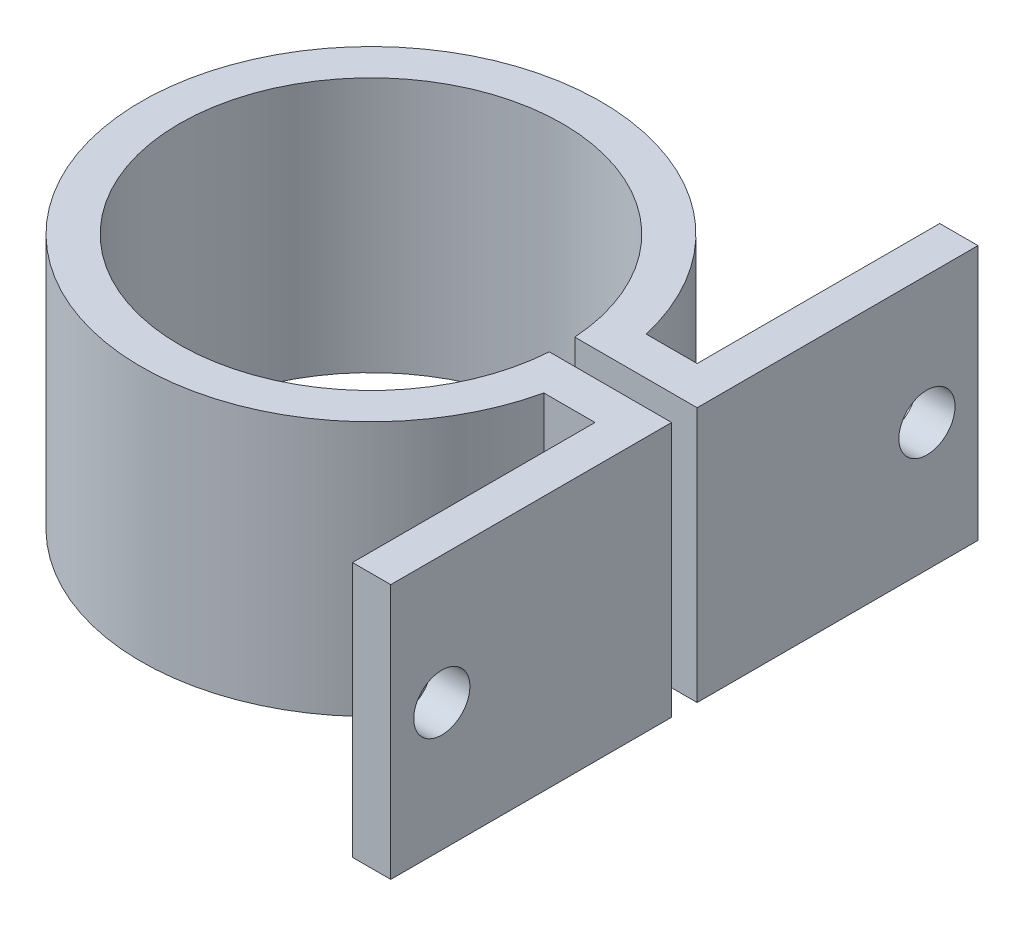
ISO-10303-21;
HEADER;
FILE_DESCRIPTION(('STEP AP214'),'2;1');
FILE_NAME('part.step','',(''),(''),'','','');
FILE_SCHEMA(('AUTOMOTIVE_DESIGN { 1 0 10303 214 1 1 1 1 }'));
ENDSEC;
DATA;
#1=APPLICATION_CONTEXT('core data for automotive mechanical design processes');
#2=APPLICATION_PROTOCOL_DEFINITION('international standard','automotive_design',2000,#1);
#3=PRODUCT_CONTEXT('',#1,'mechanical');
#4=PRODUCT('Part','Part','',(#3));
#5=PRODUCT_RELATED_PRODUCT_CATEGORY('part','',(#4));
#6=PRODUCT_DEFINITION_FORMATION('','',#4);
#7=PRODUCT_DEFINITION_CONTEXT('part definition',#1,'design');
#8=PRODUCT_DEFINITION('design','',#6,#7);
#9=PRODUCT_DEFINITION_SHAPE('','',#8);
#10=(LENGTH_UNIT() NAMED_UNIT(*) SI_UNIT(.MILLI.,.METRE.));
#11=(NAMED_UNIT(*) PLANE_ANGLE_UNIT() SI_UNIT($,.RADIAN.));
#12=(NAMED_UNIT(*) SI_UNIT($,.STERADIAN.) SOLID_ANGLE_UNIT());
#13=UNCERTAINTY_MEASURE_WITH_UNIT(LENGTH_MEASURE(1.E-05),#10,'distance_accuracy_value','');
#14=(GEOMETRIC_REPRESENTATION_CONTEXT(3) GLOBAL_UNCERTAINTY_ASSIGNED_CONTEXT((#13)) GLOBAL_UNIT_ASSIGNED_CONTEXT((#10,
#11,#12)) REPRESENTATION_CONTEXT('',''));
#15=CARTESIAN_POINT('',(0.,0.,0.));
#16=DIRECTION('',(0.,0.,1.));
#17=DIRECTION('',(1.,0.,0.));
#18=AXIS2_PLACEMENT_3D('',#15,#16,#17);
#19=CARTESIAN_POINT('',(0.,20.,-4.00000000000013));
#20=DIRECTION('',(0.,0.,-1.));
#21=DIRECTION('',(-1.,0.,0.));
#22=AXIS2_PLACEMENT_3D('',#19,#20,#21);
#23=PLANE('',#22);
#24=DIRECTION('',(1.,0.,0.));
#25=VECTOR('',#24,1.);
#26=CARTESIAN_POINT('',(0.,0.,-4.00000000000013));
#27=LINE('',#26,#25);
#28=CARTESIAN_POINT('',(17.5499287747842,0.,-4.00000000000006));
#29=VERTEX_POINT('',#28);
#30=CARTESIAN_POINT('',(21.5499287747842,0.,-4.00000000000005));
#31=VERTEX_POINT('',#30);
#32=EDGE_CURVE('E164',#29,#31,#27,.T.);
#33=ORIENTED_EDGE('',*,*,#32,.F.);
#34=DIRECTION('',(0.,-1.,0.));
#35=VECTOR('',#34,1.);
#36=CARTESIAN_POINT('',(17.5499287747842,20.,-4.00000000000006));
#37=LINE('',#36,#35);
#38=CARTESIAN_POINT('',(17.5499287747842,20.,-4.00000000000006));
#39=VERTEX_POINT('',#38);
#40=EDGE_CURVE('E11',#39,#29,#37,.T.);
#41=ORIENTED_EDGE('',*,*,#40,.F.);
#42=DIRECTION('',(1.,0.,0.));
#43=VECTOR('',#42,1.);
#44=CARTESIAN_POINT('',(0.,20.,-4.00000000000013));
#45=LINE('',#44,#43);
#46=CARTESIAN_POINT('',(21.5499287747842,20.,-4.00000000000005));
#47=VERTEX_POINT('',#46);
#48=EDGE_CURVE('E206',#39,#47,#45,.T.);
#49=ORIENTED_EDGE('',*,*,#48,.T.);
#50=DIRECTION('',(0.,-1.,0.));
#51=VECTOR('',#50,1.);
#52=CARTESIAN_POINT('',(21.5499287747842,20.,-4.00000000000005));
#53=LINE('',#52,#51);
#54=EDGE_CURVE('E104',#47,#31,#53,.T.);
#55=ORIENTED_EDGE('',*,*,#54,.T.);
#56=EDGE_LOOP('',(#33,#41,#49,#55));
#57=FACE_BOUND('',#56,.T.);
#58=ADVANCED_FACE('F41',(#57),#23,.T.);
#59=CARTESIAN_POINT('',(0.,20.,0.));
#60=DIRECTION('',(0.,-1.,0.));
#61=DIRECTION('',(0.,0.,-1.));
#62=AXIS2_PLACEMENT_3D('',#59,#60,#61);
#63=CYLINDRICAL_SURFACE('',#62,18.);
#64=CARTESIAN_POINT('',(0.,0.,0.));
#65=DIRECTION('',(0.,1.,0.));
#66=DIRECTION('',(0.,0.,1.));
#67=AXIS2_PLACEMENT_3D('',#64,#65,#66);
#68=CIRCLE('',#67,18.);
#69=CARTESIAN_POINT('',(17.5499287747842,0.,4.00000000000014));
#70=VERTEX_POINT('',#69);
#71=EDGE_CURVE('E168',#29,#70,#68,.T.);
#72=ORIENTED_EDGE('',*,*,#71,.T.);
#73=DIRECTION('',(0.,-1.,0.));
#74=VECTOR('',#73,1.);
#75=CARTESIAN_POINT('',(17.5499287747842,20.,4.00000000000014));
#76=LINE('',#75,#74);
#77=CARTESIAN_POINT('',(17.5499287747842,20.,4.00000000000014));
#78=VERTEX_POINT('',#77);
#79=EDGE_CURVE('E50',#78,#70,#76,.T.);
#80=ORIENTED_EDGE('',*,*,#79,.F.);
#81=CARTESIAN_POINT('',(0.,20.,0.));
#82=DIRECTION('',(0.,1.,0.));
#83=DIRECTION('',(0.,0.,1.));
#84=AXIS2_PLACEMENT_3D('',#81,#82,#83);
#85=CIRCLE('',#84,18.);
#86=EDGE_CURVE('E303',#39,#78,#85,.T.);
#87=ORIENTED_EDGE('',*,*,#86,.F.);
#88=ORIENTED_EDGE('',*,*,#40,.T.);
#89=EDGE_LOOP('',(#72,#80,#87,#88));
#90=FACE_BOUND('',#89,.T.);
#91=ADVANCED_FACE('F297',(#90),#63,.T.);
#92=CARTESIAN_POINT('',(1.95156391047439E-13,20.,4.00000000000099));
#93=DIRECTION('',(0.,0.,-1.));
#94=DIRECTION('',(-1.,0.,0.));
#95=AXIS2_PLACEMENT_3D('',#92,#93,#94);
#96=PLANE('',#95);
#97=DIRECTION('',(1.,0.,0.));
#98=VECTOR('',#97,1.);
#99=CARTESIAN_POINT('',(1.95156391047439E-13,0.,4.00000000000099));
#100=LINE('',#99,#98);
#101=CARTESIAN_POINT('',(21.5499287747842,0.,3.99999999999994));
#102=VERTEX_POINT('',#101);
#103=EDGE_CURVE('E172',#70,#102,#100,.T.);
#104=ORIENTED_EDGE('',*,*,#103,.T.);
#105=DIRECTION('',(0.,-1.,0.));
#106=VECTOR('',#105,1.);
#107=CARTESIAN_POINT('',(21.5499287747842,20.,3.99999999999994));
#108=LINE('',#107,#106);
#109=CARTESIAN_POINT('',(21.5499287747842,20.,3.99999999999994));
#110=VERTEX_POINT('',#109);
#111=EDGE_CURVE('E229',#110,#102,#108,.T.);
#112=ORIENTED_EDGE('',*,*,#111,.F.);
#113=DIRECTION('',(1.,0.,0.));
#114=VECTOR('',#113,1.);
#115=CARTESIAN_POINT('',(1.95156391047439E-13,20.,4.00000000000099));
#116=LINE('',#115,#114);
#117=EDGE_CURVE('E240',#78,#110,#116,.T.);
#118=ORIENTED_EDGE('',*,*,#117,.F.);
#119=ORIENTED_EDGE('',*,*,#79,.T.);
#120=EDGE_LOOP('',(#104,#112,#118,#119));
#121=FACE_BOUND('',#120,.T.);
#122=ADVANCED_FACE('F238',(#121),#96,.F.);
#123=CARTESIAN_POINT('',(21.5499287747842,20.,0.));
#124=DIRECTION('',(1.,0.,0.));
#125=DIRECTION('',(0.,0.,-1.));
#126=AXIS2_PLACEMENT_3D('',#123,#124,#125);
#127=PLANE('',#126);
#128=CARTESIAN_POINT('',(21.5499287747842,10.,18.9999999999999));
#129=DIRECTION('',(1.,0.,0.));
#130=DIRECTION('',(0.,0.,-1.));
#131=AXIS2_PLACEMENT_3D('',#128,#129,#130);
#132=CIRCLE('',#131,2.2);
#133=CARTESIAN_POINT('',(21.5499287747842,10.,16.7999999999999));
#134=VERTEX_POINT('',#133);
#135=EDGE_CURVE('E308',#134,#134,#132,.F.);
#136=ORIENTED_EDGE('',*,*,#135,.F.);
#137=EDGE_LOOP('',(#136));
#138=FACE_BOUND('',#137,.T.);
#139=DIRECTION('',(0.,0.,1.));
#140=VECTOR('',#139,1.);
#141=CARTESIAN_POINT('',(21.5499287747842,0.,0.));
#142=LINE('',#141,#140);
#143=CARTESIAN_POINT('',(21.5499287747842,0.,22.9999999999999));
#144=VERTEX_POINT('',#143);
#145=EDGE_CURVE('E175',#102,#144,#142,.T.);
#146=ORIENTED_EDGE('',*,*,#145,.T.);
#147=DIRECTION('',(0.,-1.,0.));
#148=VECTOR('',#147,1.);
#149=CARTESIAN_POINT('',(21.5499287747842,20.,22.9999999999999));
#150=LINE('',#149,#148);
#151=CARTESIAN_POINT('',(21.5499287747842,20.,22.9999999999999));
#152=VERTEX_POINT('',#151);
#153=EDGE_CURVE('E225',#152,#144,#150,.T.);
#154=ORIENTED_EDGE('',*,*,#153,.F.);
#155=DIRECTION('',(0.,0.,1.));
#156=VECTOR('',#155,1.);
#157=CARTESIAN_POINT('',(21.5499287747842,20.,0.));
#158=LINE('',#157,#156);
#159=EDGE_CURVE('E260',#110,#152,#158,.T.);
#160=ORIENTED_EDGE('',*,*,#159,.F.);
#161=ORIENTED_EDGE('',*,*,#111,.T.);
#162=EDGE_LOOP('',(#146,#154,#160,#161));
#163=FACE_BOUND('',#162,.T.);
#164=ADVANCED_FACE('F249',(#138,#163),#127,.F.);
#165=CARTESIAN_POINT('',(0.,20.,22.9999999999999));
#166=DIRECTION('',(0.,0.,-1.));
#167=DIRECTION('',(-1.,0.,0.));
#168=AXIS2_PLACEMENT_3D('',#165,#166,#167);
#169=PLANE('',#168);
#170=DIRECTION('',(1.,0.,0.));
#171=VECTOR('',#170,1.);
#172=CARTESIAN_POINT('',(0.,0.,22.9999999999999));
#173=LINE('',#172,#171);
#174=CARTESIAN_POINT('',(24.5499287747842,0.,22.9999999999999));
#175=VERTEX_POINT('',#174);
#176=EDGE_CURVE('E178',#144,#175,#173,.T.);
#177=ORIENTED_EDGE('',*,*,#176,.T.);
#178=DIRECTION('',(0.,-1.,0.));
#179=VECTOR('',#178,1.);
#180=CARTESIAN_POINT('',(24.5499287747842,20.,22.9999999999999));
#181=LINE('',#180,#179);
#182=CARTESIAN_POINT('',(24.5499287747842,20.,22.9999999999999));
#183=VERTEX_POINT('',#182);
#184=EDGE_CURVE('E222',#183,#175,#181,.T.);
#185=ORIENTED_EDGE('',*,*,#184,.F.);
#186=DIRECTION('',(1.,0.,0.));
#187=VECTOR('',#186,1.);
#188=CARTESIAN_POINT('',(0.,20.,22.9999999999999));
#189=LINE('',#188,#187);
#190=EDGE_CURVE('E255',#152,#183,#189,.T.);
#191=ORIENTED_EDGE('',*,*,#190,.F.);
#192=ORIENTED_EDGE('',*,*,#153,.T.);
#193=EDGE_LOOP('',(#177,#185,#191,#192));
#194=FACE_BOUND('',#193,.T.);
#195=ADVANCED_FACE('F253',(#194),#169,.F.);
#196=CARTESIAN_POINT('',(24.5499287747842,20.,0.));
#197=DIRECTION('',(1.,0.,0.));
#198=DIRECTION('',(0.,0.,-1.));
#199=AXIS2_PLACEMENT_3D('',#196,#197,#198);
#200=PLANE('',#199);
#201=CARTESIAN_POINT('',(24.5499287747843,10.,18.9999999999999));
#202=DIRECTION('',(1.,0.,0.));
#203=DIRECTION('',(0.,0.,-1.));
#204=AXIS2_PLACEMENT_3D('',#201,#202,#203);
#205=CIRCLE('',#204,2.2);
#206=CARTESIAN_POINT('',(24.5499287747843,10.,16.7999999999999));
#207=VERTEX_POINT('',#206);
#208=EDGE_CURVE('E314',#207,#207,#205,.T.);
#209=ORIENTED_EDGE('',*,*,#208,.F.);
#210=EDGE_LOOP('',(#209));
#211=FACE_BOUND('',#210,.T.);
#212=DIRECTION('',(0.,0.,1.));
#213=VECTOR('',#212,1.);
#214=CARTESIAN_POINT('',(24.5499287747842,0.,0.));
#215=LINE('',#214,#213);
#216=CARTESIAN_POINT('',(24.5499287747842,0.,0.999999999999942));
#217=VERTEX_POINT('',#216);
#218=EDGE_CURVE('E182',#217,#175,#215,.T.);
#219=ORIENTED_EDGE('',*,*,#218,.F.);
#220=DIRECTION('',(0.,-1.,0.));
#221=VECTOR('',#220,1.);
#222=CARTESIAN_POINT('',(24.5499287747842,20.,0.999999999999942));
#223=LINE('',#222,#221);
#224=CARTESIAN_POINT('',(24.5499287747842,20.,0.999999999999942));
#225=VERTEX_POINT('',#224);
#226=EDGE_CURVE('E219',#225,#217,#223,.T.);
#227=ORIENTED_EDGE('',*,*,#226,.F.);
#228=DIRECTION('',(0.,0.,1.));
#229=VECTOR('',#228,1.);
#230=CARTESIAN_POINT('',(24.5499287747842,20.,0.));
#231=LINE('',#230,#229);
#232=EDGE_CURVE('E259',#225,#183,#231,.T.);
#233=ORIENTED_EDGE('',*,*,#232,.T.);
#234=ORIENTED_EDGE('',*,*,#184,.T.);
#235=EDGE_LOOP('',(#219,#227,#233,#234));
#236=FACE_BOUND('',#235,.T.);
#237=ADVANCED_FACE('F379',(#211,#236),#200,.T.);
#238=CARTESIAN_POINT('',(0.,20.,1.00000000000044));
#239=DIRECTION('',(0.,0.,-1.));
#240=DIRECTION('',(-1.,0.,0.));
#241=AXIS2_PLACEMENT_3D('',#238,#239,#240);
#242=PLANE('',#241);
#243=DIRECTION('',(1.,0.,0.));
#244=VECTOR('',#243,1.);
#245=CARTESIAN_POINT('',(0.,0.,1.00000000000044));
#246=LINE('',#245,#244);
#247=CARTESIAN_POINT('',(14.9666295470958,0.,1.00000000000014));
#248=VERTEX_POINT('',#247);
#249=EDGE_CURVE('E186',#248,#217,#246,.T.);
#250=ORIENTED_EDGE('',*,*,#249,.F.);
#251=DIRECTION('',(0.,-1.,0.));
#252=VECTOR('',#251,1.);
#253=CARTESIAN_POINT('',(14.9666295470958,20.,1.00000000000014));
#254=LINE('',#253,#252);
#255=CARTESIAN_POINT('',(14.9666295470958,20.,1.00000000000014));
#256=VERTEX_POINT('',#255);
#257=EDGE_CURVE('E216',#256,#248,#254,.T.);
#258=ORIENTED_EDGE('',*,*,#257,.F.);
#259=DIRECTION('',(1.,0.,0.));
#260=VECTOR('',#259,1.);
#261=CARTESIAN_POINT('',(0.,20.,1.00000000000044));
#262=LINE('',#261,#260);
#263=EDGE_CURVE('E264',#256,#225,#262,.T.);
#264=ORIENTED_EDGE('',*,*,#263,.T.);
#265=ORIENTED_EDGE('',*,*,#226,.T.);
#266=EDGE_LOOP('',(#250,#258,#264,#265));
#267=FACE_BOUND('',#266,.T.);
#268=ADVANCED_FACE('F282',(#267),#242,.T.);
#269=CARTESIAN_POINT('',(0.,20.,0.));
#270=DIRECTION('',(0.,-1.,0.));
#271=DIRECTION('',(0.,0.,-1.));
#272=AXIS2_PLACEMENT_3D('',#269,#270,#271);
#273=CYLINDRICAL_SURFACE('',#272,15.);
#274=CARTESIAN_POINT('',(0.,0.,0.));
#275=DIRECTION('',(0.,1.,0.));
#276=DIRECTION('',(0.,0.,1.));
#277=AXIS2_PLACEMENT_3D('',#274,#275,#276);
#278=CIRCLE('',#277,15.);
#279=CARTESIAN_POINT('',(14.9666295470958,0.,-0.999999999999862));
#280=VERTEX_POINT('',#279);
#281=EDGE_CURVE('E190',#280,#248,#278,.T.);
#282=ORIENTED_EDGE('',*,*,#281,.F.);
#283=DIRECTION('',(0.,-1.,0.));
#284=VECTOR('',#283,1.);
#285=CARTESIAN_POINT('',(14.9666295470958,20.,-0.999999999999862));
#286=LINE('',#285,#284);
#287=CARTESIAN_POINT('',(14.9666295470958,20.,-0.999999999999862));
#288=VERTEX_POINT('',#287);
#289=EDGE_CURVE('E213',#288,#280,#286,.T.);
#290=ORIENTED_EDGE('',*,*,#289,.F.);
#291=CARTESIAN_POINT('',(0.,20.,0.));
#292=DIRECTION('',(0.,1.,0.));
#293=DIRECTION('',(0.,0.,1.));
#294=AXIS2_PLACEMENT_3D('',#291,#292,#293);
#295=CIRCLE('',#294,15.);
#296=EDGE_CURVE('E272',#288,#256,#295,.T.);
#297=ORIENTED_EDGE('',*,*,#296,.T.);
#298=ORIENTED_EDGE('',*,*,#257,.T.);
#299=EDGE_LOOP('',(#282,#290,#297,#298));
#300=FACE_BOUND('',#299,.T.);
#301=ADVANCED_FACE('F278',(#300),#273,.F.);
#302=CARTESIAN_POINT('',(0.,20.,-0.999999999999558));
#303=DIRECTION('',(0.,0.,-1.));
#304=DIRECTION('',(-1.,0.,0.));
#305=AXIS2_PLACEMENT_3D('',#302,#303,#304);
#306=PLANE('',#305);
#307=DIRECTION('',(1.,0.,0.));
#308=VECTOR('',#307,1.);
#309=CARTESIAN_POINT('',(0.,0.,-0.999999999999558));
#310=LINE('',#309,#308);
#311=CARTESIAN_POINT('',(24.5499287747843,0.,-1.00000000000006));
#312=VERTEX_POINT('',#311);
#313=EDGE_CURVE('E194',#280,#312,#310,.T.);
#314=ORIENTED_EDGE('',*,*,#313,.T.);
#315=DIRECTION('',(0.,-1.,0.));
#316=VECTOR('',#315,1.);
#317=CARTESIAN_POINT('',(24.5499287747843,20.,-1.00000000000006));
#318=LINE('',#317,#316);
#319=CARTESIAN_POINT('',(24.5499287747843,20.,-1.00000000000006));
#320=VERTEX_POINT('',#319);
#321=EDGE_CURVE('E147',#320,#312,#318,.T.);
#322=ORIENTED_EDGE('',*,*,#321,.F.);
#323=DIRECTION('',(1.,0.,0.));
#324=VECTOR('',#323,1.);
#325=CARTESIAN_POINT('',(0.,20.,-0.999999999999558));
#326=LINE('',#325,#324);
#327=EDGE_CURVE('E153',#288,#320,#326,.T.);
#328=ORIENTED_EDGE('',*,*,#327,.F.);
#329=ORIENTED_EDGE('',*,*,#289,.T.);
#330=EDGE_LOOP('',(#314,#322,#328,#329));
#331=FACE_BOUND('',#330,.T.);
#332=ADVANCED_FACE('F286',(#331),#306,.F.);
#333=CARTESIAN_POINT('',(24.5499287747843,20.,0.));
#334=DIRECTION('',(1.,0.,0.));
#335=DIRECTION('',(0.,0.,-1.));
#336=AXIS2_PLACEMENT_3D('',#333,#334,#335);
#337=PLANE('',#336);
#338=CARTESIAN_POINT('',(24.5499287747842,10.,-19.));
#339=DIRECTION('',(1.,0.,0.));
#340=DIRECTION('',(0.,0.,-1.));
#341=AXIS2_PLACEMENT_3D('',#338,#339,#340);
#342=CIRCLE('',#341,2.2);
#343=CARTESIAN_POINT('',(24.5499287747842,10.,-21.2));
#344=VERTEX_POINT('',#343);
#345=EDGE_CURVE('E313',#344,#344,#342,.T.);
#346=ORIENTED_EDGE('',*,*,#345,.F.);
#347=EDGE_LOOP('',(#346));
#348=FACE_BOUND('',#347,.T.);
#349=DIRECTION('',(0.,0.,1.));
#350=VECTOR('',#349,1.);
#351=CARTESIAN_POINT('',(24.5499287747843,0.,0.));
#352=LINE('',#351,#350);
#353=CARTESIAN_POINT('',(24.5499287747842,0.,-23.));
#354=VERTEX_POINT('',#353);
#355=EDGE_CURVE('E141',#354,#312,#352,.T.);
#356=ORIENTED_EDGE('',*,*,#355,.F.);
#357=DIRECTION('',(0.,-1.,0.));
#358=VECTOR('',#357,1.);
#359=CARTESIAN_POINT('',(24.5499287747842,20.,-23.));
#360=LINE('',#359,#358);
#361=CARTESIAN_POINT('',(24.5499287747842,20.,-23.));
#362=VERTEX_POINT('',#361);
#363=EDGE_CURVE('E136',#362,#354,#360,.T.);
#364=ORIENTED_EDGE('',*,*,#363,.F.);
#365=DIRECTION('',(0.,0.,1.));
#366=VECTOR('',#365,1.);
#367=CARTESIAN_POINT('',(24.5499287747843,20.,0.));
#368=LINE('',#367,#366);
#369=EDGE_CURVE('E139',#362,#320,#368,.T.);
#370=ORIENTED_EDGE('',*,*,#369,.T.);
#371=ORIENTED_EDGE('',*,*,#321,.T.);
#372=EDGE_LOOP('',(#356,#364,#370,#371));
#373=FACE_BOUND('',#372,.T.);
#374=ADVANCED_FACE('F138',(#348,#373),#337,.T.);
#375=CARTESIAN_POINT('',(0.,20.,-23.));
#376=DIRECTION('',(0.,0.,-1.));
#377=DIRECTION('',(-1.,0.,0.));
#378=AXIS2_PLACEMENT_3D('',#375,#376,#377);
#379=PLANE('',#378);
#380=DIRECTION('',(1.,0.,0.));
#381=VECTOR('',#380,1.);
#382=CARTESIAN_POINT('',(0.,0.,-23.));
#383=LINE('',#382,#381);
#384=CARTESIAN_POINT('',(21.5499287747842,0.,-23.));
#385=VERTEX_POINT('',#384);
#386=EDGE_CURVE('E200',#385,#354,#383,.T.);
#387=ORIENTED_EDGE('',*,*,#386,.F.);
#388=DIRECTION('',(0.,-1.,0.));
#389=VECTOR('',#388,1.);
#390=CARTESIAN_POINT('',(21.5499287747842,20.,-23.));
#391=LINE('',#390,#389);
#392=CARTESIAN_POINT('',(21.5499287747842,20.,-23.));
#393=VERTEX_POINT('',#392);
#394=EDGE_CURVE('E97',#393,#385,#391,.T.);
#395=ORIENTED_EDGE('',*,*,#394,.F.);
#396=DIRECTION('',(1.,0.,0.));
#397=VECTOR('',#396,1.);
#398=CARTESIAN_POINT('',(0.,20.,-23.));
#399=LINE('',#398,#397);
#400=EDGE_CURVE('E150',#393,#362,#399,.T.);
#401=ORIENTED_EDGE('',*,*,#400,.T.);
#402=ORIENTED_EDGE('',*,*,#363,.T.);
#403=EDGE_LOOP('',(#387,#395,#401,#402));
#404=FACE_BOUND('',#403,.T.);
#405=ADVANCED_FACE('F157',(#404),#379,.T.);
#406=CARTESIAN_POINT('',(21.5499287747842,20.,0.));
#407=DIRECTION('',(1.,0.,0.));
#408=DIRECTION('',(0.,0.,-1.));
#409=AXIS2_PLACEMENT_3D('',#406,#407,#408);
#410=PLANE('',#409);
#411=CARTESIAN_POINT('',(21.5499287747843,10.,-19.));
#412=DIRECTION('',(1.,0.,0.));
#413=DIRECTION('',(0.,0.,-1.));
#414=AXIS2_PLACEMENT_3D('',#411,#412,#413);
#415=CIRCLE('',#414,2.2);
#416=CARTESIAN_POINT('',(21.5499287747843,10.,-21.2));
#417=VERTEX_POINT('',#416);
#418=EDGE_CURVE('E169',#417,#417,#415,.F.);
#419=ORIENTED_EDGE('',*,*,#418,.F.);
#420=EDGE_LOOP('',(#419));
#421=FACE_BOUND('',#420,.T.);
#422=DIRECTION('',(0.,0.,1.));
#423=VECTOR('',#422,1.);
#424=CARTESIAN_POINT('',(21.5499287747842,0.,0.));
#425=LINE('',#424,#423);
#426=EDGE_CURVE('E203',#385,#31,#425,.T.);
#427=ORIENTED_EDGE('',*,*,#426,.T.);
#428=ORIENTED_EDGE('',*,*,#54,.F.);
#429=DIRECTION('',(0.,0.,1.));
#430=VECTOR('',#429,1.);
#431=CARTESIAN_POINT('',(21.5499287747842,20.,0.));
#432=LINE('',#431,#430);
#433=EDGE_CURVE('E58',#393,#47,#432,.T.);
#434=ORIENTED_EDGE('',*,*,#433,.F.);
#435=ORIENTED_EDGE('',*,*,#394,.T.);
#436=EDGE_LOOP('',(#427,#428,#434,#435));
#437=FACE_BOUND('',#436,.T.);
#438=ADVANCED_FACE('F301',(#421,#437),#410,.F.);
#439=CARTESIAN_POINT('',(0.,20.,0.));
#440=DIRECTION('',(0.,1.,0.));
#441=DIRECTION('',(0.,0.,1.));
#442=AXIS2_PLACEMENT_3D('',#439,#440,#441);
#443=PLANE('',#442);
#444=ORIENTED_EDGE('',*,*,#48,.F.);
#445=ORIENTED_EDGE('',*,*,#86,.T.);
#446=ORIENTED_EDGE('',*,*,#117,.T.);
#447=ORIENTED_EDGE('',*,*,#159,.T.);
#448=ORIENTED_EDGE('',*,*,#190,.T.);
#449=ORIENTED_EDGE('',*,*,#232,.F.);
#450=ORIENTED_EDGE('',*,*,#263,.F.);
#451=ORIENTED_EDGE('',*,*,#296,.F.);
#452=ORIENTED_EDGE('',*,*,#327,.T.);
#453=ORIENTED_EDGE('',*,*,#369,.F.);
#454=ORIENTED_EDGE('',*,*,#400,.F.);
#455=ORIENTED_EDGE('',*,*,#433,.T.);
#456=EDGE_LOOP('',(#444,#445,#446,#447,#448,#449,#450,#451,#452,#453,#454,#455));
#457=FACE_BOUND('',#456,.T.);
#458=ADVANCED_FACE('F149',(#457),#443,.T.);
#459=CARTESIAN_POINT('',(0.,0.,0.));
#460=DIRECTION('',(0.,1.,0.));
#461=DIRECTION('',(0.,0.,1.));
#462=AXIS2_PLACEMENT_3D('',#459,#460,#461);
#463=PLANE('',#462);
#464=ORIENTED_EDGE('',*,*,#32,.T.);
#465=ORIENTED_EDGE('',*,*,#426,.F.);
#466=ORIENTED_EDGE('',*,*,#386,.T.);
#467=ORIENTED_EDGE('',*,*,#355,.T.);
#468=ORIENTED_EDGE('',*,*,#313,.F.);
#469=ORIENTED_EDGE('',*,*,#281,.T.);
#470=ORIENTED_EDGE('',*,*,#249,.T.);
#471=ORIENTED_EDGE('',*,*,#218,.T.);
#472=ORIENTED_EDGE('',*,*,#176,.F.);
#473=ORIENTED_EDGE('',*,*,#145,.F.);
#474=ORIENTED_EDGE('',*,*,#103,.F.);
#475=ORIENTED_EDGE('',*,*,#71,.F.);
#476=EDGE_LOOP('',(#464,#465,#466,#467,#468,#469,#470,#471,#472,#473,#474,#475));
#477=FACE_BOUND('',#476,.T.);
#478=ADVANCED_FACE('F245',(#477),#463,.F.);
#479=CARTESIAN_POINT('',(15.3273891003426,10.,-19.));
#480=DIRECTION('',(1.,0.,0.));
#481=DIRECTION('',(0.,0.,-1.));
#482=AXIS2_PLACEMENT_3D('',#479,#480,#481);
#483=CYLINDRICAL_SURFACE('',#482,2.2);
#484=ORIENTED_EDGE('',*,*,#418,.T.);
#485=EDGE_LOOP('',(#484));
#486=FACE_BOUND('',#485,.T.);
#487=ORIENTED_EDGE('',*,*,#345,.T.);
#488=EDGE_LOOP('',(#487));
#489=FACE_BOUND('',#488,.T.);
#490=ADVANCED_FACE('F325',(#486,#489),#483,.F.);
#491=CARTESIAN_POINT('',(15.3273891003426,10.,19.));
#492=DIRECTION('',(1.,0.,0.));
#493=DIRECTION('',(0.,0.,-1.));
#494=AXIS2_PLACEMENT_3D('',#491,#492,#493);
#495=CYLINDRICAL_SURFACE('',#494,2.2);
#496=ORIENTED_EDGE('',*,*,#135,.T.);
#497=EDGE_LOOP('',(#496));
#498=FACE_BOUND('',#497,.T.);
#499=ORIENTED_EDGE('',*,*,#208,.T.);
#500=EDGE_LOOP('',(#499));
#501=FACE_BOUND('',#500,.T.);
#502=ADVANCED_FACE('F327',(#498,#501),#495,.F.);
#503=CLOSED_SHELL('',(#58,#91,#122,#164,#195,#237,#268,#301,#332,#374,#405,#438,#458,#478,#490,#502));
#504=MANIFOLD_SOLID_BREP('B2',#503);
#505=ADVANCED_BREP_SHAPE_REPRESENTATION('',(#18,#504),#14);
#506=SHAPE_DEFINITION_REPRESENTATION(#9,#505);
ENDSEC;
END-ISO-10303-21;
